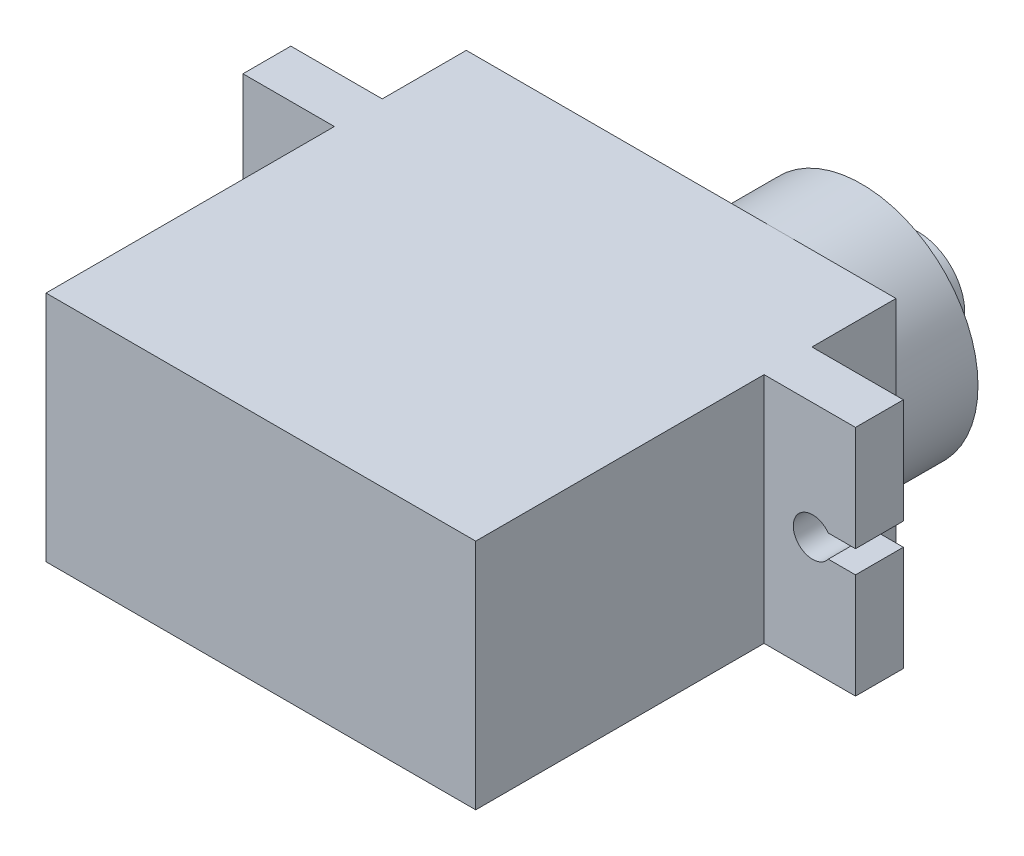
ISO-10303-21;
HEADER;
FILE_DESCRIPTION(('STEP AP214'),'2;1');
FILE_NAME('part.step','',(''),(''),'','','');
FILE_SCHEMA(('AUTOMOTIVE_DESIGN { 1 0 10303 214 1 1 1 1 }'));
ENDSEC;
DATA;
#1=APPLICATION_CONTEXT('core data for automotive mechanical design processes');
#2=APPLICATION_PROTOCOL_DEFINITION('international standard','automotive_design',2000,#1);
#3=PRODUCT_CONTEXT('',#1,'mechanical');
#4=PRODUCT('Part','Part','',(#3));
#5=PRODUCT_RELATED_PRODUCT_CATEGORY('part','',(#4));
#6=PRODUCT_DEFINITION_FORMATION('','',#4);
#7=PRODUCT_DEFINITION_CONTEXT('part definition',#1,'design');
#8=PRODUCT_DEFINITION('design','',#6,#7);
#9=PRODUCT_DEFINITION_SHAPE('','',#8);
#10=(LENGTH_UNIT() NAMED_UNIT(*) SI_UNIT(.MILLI.,.METRE.));
#11=(NAMED_UNIT(*) PLANE_ANGLE_UNIT() SI_UNIT($,.RADIAN.));
#12=(NAMED_UNIT(*) SI_UNIT($,.STERADIAN.) SOLID_ANGLE_UNIT());
#13=UNCERTAINTY_MEASURE_WITH_UNIT(LENGTH_MEASURE(1.E-05),#10,'distance_accuracy_value','');
#14=(GEOMETRIC_REPRESENTATION_CONTEXT(3) GLOBAL_UNCERTAINTY_ASSIGNED_CONTEXT((#13)) GLOBAL_UNIT_ASSIGNED_CONTEXT((#10,
#11,#12)) REPRESENTATION_CONTEXT('',''));
#15=CARTESIAN_POINT('',(0.,0.,0.));
#16=DIRECTION('',(0.,0.,1.));
#17=DIRECTION('',(1.,0.,0.));
#18=AXIS2_PLACEMENT_3D('',#15,#16,#17);
#19=CARTESIAN_POINT('',(11.4,6.175,-11.15));
#20=DIRECTION('',(0.,0.,1.));
#21=DIRECTION('',(1.,0.,0.));
#22=AXIS2_PLACEMENT_3D('',#19,#20,#21);
#23=PLANE('',#22);
#24=CARTESIAN_POINT('',(5.225,0.,-11.15));
#25=DIRECTION('',(0.,0.,-1.));
#26=DIRECTION('',(-1.,0.,0.));
#27=AXIS2_PLACEMENT_3D('',#24,#25,#26);
#28=CIRCLE('',#27,6.175);
#29=CARTESIAN_POINT('',(5.225,6.175,-11.15));
#30=VERTEX_POINT('',#29);
#31=CARTESIAN_POINT('',(11.4,0.,-11.15));
#32=VERTEX_POINT('',#31);
#33=EDGE_CURVE('E208',#30,#32,#28,.T.);
#34=ORIENTED_EDGE('',*,*,#33,.F.);
#35=DIRECTION('',(-1.,0.,0.));
#36=VECTOR('',#35,1.);
#37=CARTESIAN_POINT('',(11.4,6.175,-11.15));
#38=LINE('',#37,#36);
#39=CARTESIAN_POINT('',(11.4,6.175,-11.15));
#40=VERTEX_POINT('',#39);
#41=EDGE_CURVE('E190',#40,#30,#38,.T.);
#42=ORIENTED_EDGE('',*,*,#41,.F.);
#43=DIRECTION('',(0.,-1.,0.));
#44=VECTOR('',#43,1.);
#45=CARTESIAN_POINT('',(11.4,6.175,-11.15));
#46=LINE('',#45,#44);
#47=EDGE_CURVE('E209',#40,#32,#46,.T.);
#48=ORIENTED_EDGE('',*,*,#47,.T.);
#49=EDGE_LOOP('',(#34,#42,#48));
#50=FACE_BOUND('',#49,.T.);
#51=ADVANCED_FACE('F42',(#50),#23,.F.);
#52=CARTESIAN_POINT('',(5.225,-6.175,-11.15));
#53=VERTEX_POINT('',#52);
#54=EDGE_CURVE('E51',#32,#53,#28,.T.);
#55=ORIENTED_EDGE('',*,*,#54,.F.);
#56=CARTESIAN_POINT('',(11.4,-6.175,-11.15));
#57=VERTEX_POINT('',#56);
#58=EDGE_CURVE('E334',#32,#57,#46,.T.);
#59=ORIENTED_EDGE('',*,*,#58,.T.);
#60=DIRECTION('',(-1.,0.,0.));
#61=VECTOR('',#60,1.);
#62=CARTESIAN_POINT('',(11.4,-6.175,-11.15));
#63=LINE('',#62,#61);
#64=EDGE_CURVE('E331',#57,#53,#63,.T.);
#65=ORIENTED_EDGE('',*,*,#64,.T.);
#66=EDGE_LOOP('',(#55,#59,#65));
#67=FACE_BOUND('',#66,.T.);
#68=ADVANCED_FACE('F390',(#67),#23,.F.);
#69=CARTESIAN_POINT('',(16.25,0.,0.));
#70=DIRECTION('',(1.,0.,0.));
#71=DIRECTION('',(0.,0.,-1.));
#72=AXIS2_PLACEMENT_3D('',#69,#70,#71);
#73=PLANE('',#72);
#74=DIRECTION('',(0.,0.,-1.));
#75=VECTOR('',#74,1.);
#76=CARTESIAN_POINT('',(16.25,-0.6,0.));
#77=LINE('',#76,#75);
#78=CARTESIAN_POINT('',(16.25,-0.6,-4.15000000000001));
#79=VERTEX_POINT('',#78);
#80=CARTESIAN_POINT('',(16.25,-0.6,-6.69000000000001));
#81=VERTEX_POINT('',#80);
#82=EDGE_CURVE('E46',#79,#81,#77,.T.);
#83=ORIENTED_EDGE('',*,*,#82,.F.);
#84=DIRECTION('',(0.,-1.,0.));
#85=VECTOR('',#84,1.);
#86=CARTESIAN_POINT('',(16.25,6.175,-4.15000000000001));
#87=LINE('',#86,#85);
#88=CARTESIAN_POINT('',(16.25,-6.175,-4.15000000000001));
#89=VERTEX_POINT('',#88);
#90=EDGE_CURVE('E290',#79,#89,#87,.T.);
#91=ORIENTED_EDGE('',*,*,#90,.T.);
#92=DIRECTION('',(0.,0.,-1.));
#93=VECTOR('',#92,1.);
#94=CARTESIAN_POINT('',(16.25,-6.175,-4.15000000000001));
#95=LINE('',#94,#93);
#96=CARTESIAN_POINT('',(16.25,-6.175,-6.69000000000001));
#97=VERTEX_POINT('',#96);
#98=EDGE_CURVE('E289',#89,#97,#95,.T.);
#99=ORIENTED_EDGE('',*,*,#98,.T.);
#100=DIRECTION('',(0.,1.,0.));
#101=VECTOR('',#100,1.);
#102=CARTESIAN_POINT('',(16.25,6.175,-6.69000000000001));
#103=LINE('',#102,#101);
#104=EDGE_CURVE('E293',#97,#81,#103,.T.);
#105=ORIENTED_EDGE('',*,*,#104,.T.);
#106=EDGE_LOOP('',(#83,#91,#99,#105));
#107=FACE_BOUND('',#106,.T.);
#108=ADVANCED_FACE('F376',(#107),#73,.T.);
#109=CARTESIAN_POINT('',(-16.25,0.,0.));
#110=DIRECTION('',(-1.,0.,0.));
#111=DIRECTION('',(0.,0.,-1.));
#112=AXIS2_PLACEMENT_3D('',#109,#110,#111);
#113=PLANE('',#112);
#114=DIRECTION('',(0.,0.,-1.));
#115=VECTOR('',#114,1.);
#116=CARTESIAN_POINT('',(-16.25,0.6,0.));
#117=LINE('',#116,#115);
#118=CARTESIAN_POINT('',(-16.25,0.6,-4.15000000000001));
#119=VERTEX_POINT('',#118);
#120=CARTESIAN_POINT('',(-16.25,0.6,-6.69));
#121=VERTEX_POINT('',#120);
#122=EDGE_CURVE('E344',#119,#121,#117,.T.);
#123=ORIENTED_EDGE('',*,*,#122,.F.);
#124=DIRECTION('',(0.,-1.,0.));
#125=VECTOR('',#124,1.);
#126=CARTESIAN_POINT('',(-16.25,6.175,-4.15000000000001));
#127=LINE('',#126,#125);
#128=CARTESIAN_POINT('',(-16.25,6.175,-4.15000000000001));
#129=VERTEX_POINT('',#128);
#130=EDGE_CURVE('E258',#129,#119,#127,.T.);
#131=ORIENTED_EDGE('',*,*,#130,.F.);
#132=DIRECTION('',(0.,0.,1.));
#133=VECTOR('',#132,1.);
#134=CARTESIAN_POINT('',(-16.25,6.175,-4.15000000000001));
#135=LINE('',#134,#133);
#136=CARTESIAN_POINT('',(-16.25,6.175,-6.69000000000001));
#137=VERTEX_POINT('',#136);
#138=EDGE_CURVE('E261',#137,#129,#135,.T.);
#139=ORIENTED_EDGE('',*,*,#138,.F.);
#140=DIRECTION('',(0.,1.,0.));
#141=VECTOR('',#140,1.);
#142=CARTESIAN_POINT('',(-16.25,6.175,-6.69000000000001));
#143=LINE('',#142,#141);
#144=EDGE_CURVE('E265',#121,#137,#143,.T.);
#145=ORIENTED_EDGE('',*,*,#144,.F.);
#146=EDGE_LOOP('',(#123,#131,#139,#145));
#147=FACE_BOUND('',#146,.T.);
#148=ADVANCED_FACE('F397',(#147),#113,.T.);
#149=CARTESIAN_POINT('',(-11.4,6.175,-11.15));
#150=DIRECTION('',(1.,0.,0.));
#151=DIRECTION('',(0.,0.,-1.));
#152=AXIS2_PLACEMENT_3D('',#149,#150,#151);
#153=PLANE('',#152);
#154=DIRECTION('',(0.,0.,1.));
#155=VECTOR('',#154,1.);
#156=CARTESIAN_POINT('',(-11.4,6.175,-11.15));
#157=LINE('',#156,#155);
#158=CARTESIAN_POINT('',(-11.4,6.175,-4.15000000000001));
#159=VERTEX_POINT('',#158);
#160=CARTESIAN_POINT('',(-11.4,6.175,11.15));
#161=VERTEX_POINT('',#160);
#162=EDGE_CURVE('E318',#159,#161,#157,.T.);
#163=ORIENTED_EDGE('',*,*,#162,.F.);
#164=DIRECTION('',(0.,-1.,0.));
#165=VECTOR('',#164,1.);
#166=CARTESIAN_POINT('',(-11.4,6.175,-4.15000000000001));
#167=LINE('',#166,#165);
#168=CARTESIAN_POINT('',(-11.4,-6.175,-4.15000000000001));
#169=VERTEX_POINT('',#168);
#170=EDGE_CURVE('E257',#159,#169,#167,.T.);
#171=ORIENTED_EDGE('',*,*,#170,.T.);
#172=DIRECTION('',(0.,0.,1.));
#173=VECTOR('',#172,1.);
#174=CARTESIAN_POINT('',(-11.4,-6.175,-11.15));
#175=LINE('',#174,#173);
#176=CARTESIAN_POINT('',(-11.4,-6.175,11.15));
#177=VERTEX_POINT('',#176);
#178=EDGE_CURVE('E314',#169,#177,#175,.T.);
#179=ORIENTED_EDGE('',*,*,#178,.T.);
#180=DIRECTION('',(0.,-1.,0.));
#181=VECTOR('',#180,1.);
#182=CARTESIAN_POINT('',(-11.4,6.175,11.15));
#183=LINE('',#182,#181);
#184=EDGE_CURVE('E339',#161,#177,#183,.T.);
#185=ORIENTED_EDGE('',*,*,#184,.F.);
#186=EDGE_LOOP('',(#163,#171,#179,#185));
#187=FACE_BOUND('',#186,.T.);
#188=ADVANCED_FACE('F413',(#187),#153,.F.);
#189=CARTESIAN_POINT('',(11.4,6.175,-11.15));
#190=DIRECTION('',(-1.,0.,0.));
#191=DIRECTION('',(0.,0.,1.));
#192=AXIS2_PLACEMENT_3D('',#189,#190,#191);
#193=PLANE('',#192);
#194=DIRECTION('',(0.,-1.,0.));
#195=VECTOR('',#194,1.);
#196=CARTESIAN_POINT('',(11.4,6.175,-4.15000000000001));
#197=LINE('',#196,#195);
#198=CARTESIAN_POINT('',(11.4,6.175,-4.15000000000001));
#199=VERTEX_POINT('',#198);
#200=CARTESIAN_POINT('',(11.4,-6.175,-4.15000000000001));
#201=VERTEX_POINT('',#200);
#202=EDGE_CURVE('E285',#199,#201,#197,.T.);
#203=ORIENTED_EDGE('',*,*,#202,.F.);
#204=DIRECTION('',(0.,0.,-1.));
#205=VECTOR('',#204,1.);
#206=CARTESIAN_POINT('',(11.4,6.175,-11.15));
#207=LINE('',#206,#205);
#208=CARTESIAN_POINT('',(11.4,6.175,11.15));
#209=VERTEX_POINT('',#208);
#210=EDGE_CURVE('E206',#209,#199,#207,.T.);
#211=ORIENTED_EDGE('',*,*,#210,.F.);
#212=DIRECTION('',(0.,-1.,0.));
#213=VECTOR('',#212,1.);
#214=CARTESIAN_POINT('',(11.4,6.175,11.15));
#215=LINE('',#214,#213);
#216=CARTESIAN_POINT('',(11.4,-6.175,11.15));
#217=VERTEX_POINT('',#216);
#218=EDGE_CURVE('E336',#209,#217,#215,.T.);
#219=ORIENTED_EDGE('',*,*,#218,.T.);
#220=DIRECTION('',(0.,0.,-1.));
#221=VECTOR('',#220,1.);
#222=CARTESIAN_POINT('',(11.4,-6.175,-11.15));
#223=LINE('',#222,#221);
#224=EDGE_CURVE('E328',#217,#201,#223,.T.);
#225=ORIENTED_EDGE('',*,*,#224,.T.);
#226=EDGE_LOOP('',(#203,#211,#219,#225));
#227=FACE_BOUND('',#226,.T.);
#228=ADVANCED_FACE('F363',(#227),#193,.F.);
#229=DIRECTION('',(0.,1.,0.));
#230=VECTOR('',#229,1.);
#231=CARTESIAN_POINT('',(11.4,6.175,-6.69000000000001));
#232=LINE('',#231,#230);
#233=CARTESIAN_POINT('',(11.4,-6.175,-6.69000000000001));
#234=VERTEX_POINT('',#233);
#235=CARTESIAN_POINT('',(11.4,6.175,-6.69000000000001));
#236=VERTEX_POINT('',#235);
#237=EDGE_CURVE('E301',#234,#236,#232,.T.);
#238=ORIENTED_EDGE('',*,*,#237,.F.);
#239=EDGE_CURVE('E327',#234,#57,#223,.T.);
#240=ORIENTED_EDGE('',*,*,#239,.T.);
#241=ORIENTED_EDGE('',*,*,#58,.F.);
#242=ORIENTED_EDGE('',*,*,#47,.F.);
#243=EDGE_CURVE('E196',#236,#40,#207,.T.);
#244=ORIENTED_EDGE('',*,*,#243,.F.);
#245=EDGE_LOOP('',(#238,#240,#241,#242,#244));
#246=FACE_BOUND('',#245,.T.);
#247=ADVANCED_FACE('F388',(#246),#193,.F.);
#248=CARTESIAN_POINT('',(-11.4,-6.175,-11.15));
#249=VERTEX_POINT('',#248);
#250=CARTESIAN_POINT('',(-11.4,-6.175,-6.69000000000001));
#251=VERTEX_POINT('',#250);
#252=EDGE_CURVE('E322',#249,#251,#175,.T.);
#253=ORIENTED_EDGE('',*,*,#252,.T.);
#254=DIRECTION('',(0.,1.,0.));
#255=VECTOR('',#254,1.);
#256=CARTESIAN_POINT('',(-11.4,6.175,-6.69000000000001));
#257=LINE('',#256,#255);
#258=CARTESIAN_POINT('',(-11.4,6.175,-6.69000000000001));
#259=VERTEX_POINT('',#258);
#260=EDGE_CURVE('E275',#251,#259,#257,.T.);
#261=ORIENTED_EDGE('',*,*,#260,.T.);
#262=CARTESIAN_POINT('',(-11.4,6.175,-11.15));
#263=VERTEX_POINT('',#262);
#264=EDGE_CURVE('E315',#263,#259,#157,.T.);
#265=ORIENTED_EDGE('',*,*,#264,.F.);
#266=DIRECTION('',(0.,-1.,0.));
#267=VECTOR('',#266,1.);
#268=CARTESIAN_POINT('',(-11.4,6.175,-11.15));
#269=LINE('',#268,#267);
#270=EDGE_CURVE('E201',#263,#249,#269,.T.);
#271=ORIENTED_EDGE('',*,*,#270,.T.);
#272=EDGE_LOOP('',(#253,#261,#265,#271));
#273=FACE_BOUND('',#272,.T.);
#274=ADVANCED_FACE('F44',(#273),#153,.F.);
#275=CARTESIAN_POINT('',(11.4,6.175,11.15));
#276=DIRECTION('',(0.,0.,-1.));
#277=DIRECTION('',(-1.,0.,0.));
#278=AXIS2_PLACEMENT_3D('',#275,#276,#277);
#279=PLANE('',#278);
#280=DIRECTION('',(1.,0.,0.));
#281=VECTOR('',#280,1.);
#282=CARTESIAN_POINT('',(11.4,-6.175,11.15));
#283=LINE('',#282,#281);
#284=EDGE_CURVE('E325',#177,#217,#283,.T.);
#285=ORIENTED_EDGE('',*,*,#284,.T.);
#286=ORIENTED_EDGE('',*,*,#218,.F.);
#287=DIRECTION('',(1.,0.,0.));
#288=VECTOR('',#287,1.);
#289=CARTESIAN_POINT('',(11.4,6.175,11.15));
#290=LINE('',#289,#288);
#291=EDGE_CURVE('E317',#161,#209,#290,.T.);
#292=ORIENTED_EDGE('',*,*,#291,.F.);
#293=ORIENTED_EDGE('',*,*,#184,.T.);
#294=EDGE_LOOP('',(#285,#286,#292,#293));
#295=FACE_BOUND('',#294,.T.);
#296=ADVANCED_FACE('F402',(#295),#279,.F.);
#297=EDGE_CURVE('E66',#53,#30,#28,.T.);
#298=ORIENTED_EDGE('',*,*,#297,.F.);
#299=EDGE_CURVE('E330',#53,#249,#63,.T.);
#300=ORIENTED_EDGE('',*,*,#299,.T.);
#301=ORIENTED_EDGE('',*,*,#270,.F.);
#302=EDGE_CURVE('E193',#30,#263,#38,.T.);
#303=ORIENTED_EDGE('',*,*,#302,.F.);
#304=EDGE_LOOP('',(#298,#300,#301,#303));
#305=FACE_BOUND('',#304,.T.);
#306=ADVANCED_FACE('F203',(#305),#23,.F.);
#307=CARTESIAN_POINT('',(0.,6.175,0.));
#308=DIRECTION('',(0.,-1.,0.));
#309=DIRECTION('',(0.,0.,-1.));
#310=AXIS2_PLACEMENT_3D('',#307,#308,#309);
#311=PLANE('',#310);
#312=ORIENTED_EDGE('',*,*,#264,.T.);
#313=DIRECTION('',(1.,0.,0.));
#314=VECTOR('',#313,1.);
#315=CARTESIAN_POINT('',(-16.25,6.175,-6.69000000000001));
#316=LINE('',#315,#314);
#317=EDGE_CURVE('E281',#137,#259,#316,.T.);
#318=ORIENTED_EDGE('',*,*,#317,.F.);
#319=ORIENTED_EDGE('',*,*,#138,.T.);
#320=DIRECTION('',(1.,0.,0.));
#321=VECTOR('',#320,1.);
#322=CARTESIAN_POINT('',(-16.25,6.175,-4.15000000000001));
#323=LINE('',#322,#321);
#324=EDGE_CURVE('E283',#129,#159,#323,.T.);
#325=ORIENTED_EDGE('',*,*,#324,.T.);
#326=ORIENTED_EDGE('',*,*,#162,.T.);
#327=ORIENTED_EDGE('',*,*,#291,.T.);
#328=ORIENTED_EDGE('',*,*,#210,.T.);
#329=DIRECTION('',(-1.,0.,0.));
#330=VECTOR('',#329,1.);
#331=CARTESIAN_POINT('',(16.25,6.175,-4.15000000000001));
#332=LINE('',#331,#330);
#333=CARTESIAN_POINT('',(16.25,6.175,-4.15000000000001));
#334=VERTEX_POINT('',#333);
#335=EDGE_CURVE('E298',#334,#199,#332,.T.);
#336=ORIENTED_EDGE('',*,*,#335,.F.);
#337=DIRECTION('',(0.,0.,1.));
#338=VECTOR('',#337,1.);
#339=CARTESIAN_POINT('',(16.25,6.175,-4.15000000000001));
#340=LINE('',#339,#338);
#341=CARTESIAN_POINT('',(16.25,6.175,-6.69000000000001));
#342=VERTEX_POINT('',#341);
#343=EDGE_CURVE('E296',#342,#334,#340,.T.);
#344=ORIENTED_EDGE('',*,*,#343,.F.);
#345=DIRECTION('',(-1.,0.,0.));
#346=VECTOR('',#345,1.);
#347=CARTESIAN_POINT('',(16.25,6.175,-6.69000000000001));
#348=LINE('',#347,#346);
#349=EDGE_CURVE('E306',#342,#236,#348,.T.);
#350=ORIENTED_EDGE('',*,*,#349,.T.);
#351=ORIENTED_EDGE('',*,*,#243,.T.);
#352=ORIENTED_EDGE('',*,*,#41,.T.);
#353=ORIENTED_EDGE('',*,*,#302,.T.);
#354=EDGE_LOOP('',(#312,#318,#319,#325,#326,#327,#328,#336,#344,#350,#351,#352,#353));
#355=FACE_BOUND('',#354,.T.);
#356=ADVANCED_FACE('F192',(#355),#311,.F.);
#357=CARTESIAN_POINT('',(0.,-6.175,0.));
#358=DIRECTION('',(0.,-1.,0.));
#359=DIRECTION('',(0.,0.,-1.));
#360=AXIS2_PLACEMENT_3D('',#357,#358,#359);
#361=PLANE('',#360);
#362=ORIENTED_EDGE('',*,*,#252,.F.);
#363=ORIENTED_EDGE('',*,*,#299,.F.);
#364=ORIENTED_EDGE('',*,*,#64,.F.);
#365=ORIENTED_EDGE('',*,*,#239,.F.);
#366=DIRECTION('',(-1.,0.,0.));
#367=VECTOR('',#366,1.);
#368=CARTESIAN_POINT('',(16.25,-6.175,-6.69000000000001));
#369=LINE('',#368,#367);
#370=EDGE_CURVE('E308',#97,#234,#369,.T.);
#371=ORIENTED_EDGE('',*,*,#370,.F.);
#372=ORIENTED_EDGE('',*,*,#98,.F.);
#373=DIRECTION('',(-1.,0.,0.));
#374=VECTOR('',#373,1.);
#375=CARTESIAN_POINT('',(16.25,-6.175,-4.15000000000001));
#376=LINE('',#375,#374);
#377=EDGE_CURVE('E311',#89,#201,#376,.T.);
#378=ORIENTED_EDGE('',*,*,#377,.T.);
#379=ORIENTED_EDGE('',*,*,#224,.F.);
#380=ORIENTED_EDGE('',*,*,#284,.F.);
#381=ORIENTED_EDGE('',*,*,#178,.F.);
#382=DIRECTION('',(1.,0.,0.));
#383=VECTOR('',#382,1.);
#384=CARTESIAN_POINT('',(-16.25,-6.175,-4.15000000000001));
#385=LINE('',#384,#383);
#386=CARTESIAN_POINT('',(-16.25,-6.175,-4.15000000000001));
#387=VERTEX_POINT('',#386);
#388=EDGE_CURVE('E272',#387,#169,#385,.T.);
#389=ORIENTED_EDGE('',*,*,#388,.F.);
#390=DIRECTION('',(0.,0.,-1.));
#391=VECTOR('',#390,1.);
#392=CARTESIAN_POINT('',(-16.25,-6.175,-4.15000000000001));
#393=LINE('',#392,#391);
#394=CARTESIAN_POINT('',(-16.25,-6.175,-6.69000000000001));
#395=VERTEX_POINT('',#394);
#396=EDGE_CURVE('E269',#387,#395,#393,.T.);
#397=ORIENTED_EDGE('',*,*,#396,.T.);
#398=DIRECTION('',(1.,0.,0.));
#399=VECTOR('',#398,1.);
#400=CARTESIAN_POINT('',(-16.25,-6.175,-6.69000000000001));
#401=LINE('',#400,#399);
#402=EDGE_CURVE('E279',#395,#251,#401,.T.);
#403=ORIENTED_EDGE('',*,*,#402,.T.);
#404=EDGE_LOOP('',(#362,#363,#364,#365,#371,#372,#378,#379,#380,#381,#389,#397,#403));
#405=FACE_BOUND('',#404,.T.);
#406=ADVANCED_FACE('F370',(#405),#361,.T.);
#407=CARTESIAN_POINT('',(16.25,6.175,-4.15000000000001));
#408=DIRECTION('',(0.,0.,-1.));
#409=DIRECTION('',(-1.,0.,0.));
#410=AXIS2_PLACEMENT_3D('',#407,#408,#409);
#411=PLANE('',#410);
#412=ORIENTED_EDGE('',*,*,#90,.F.);
#413=DIRECTION('',(-1.,0.,0.));
#414=VECTOR('',#413,1.);
#415=CARTESIAN_POINT('',(16.25,-0.6,-4.15000000000001));
#416=LINE('',#415,#414);
#417=CARTESIAN_POINT('',(14.8060385069297,-0.6,-4.15000000000001));
#418=VERTEX_POINT('',#417);
#419=EDGE_CURVE('E251',#79,#418,#416,.T.);
#420=ORIENTED_EDGE('',*,*,#419,.T.);
#421=CARTESIAN_POINT('',(13.975,0.,-4.15000000000001));
#422=DIRECTION('',(0.,0.,-1.));
#423=DIRECTION('',(-1.,0.,0.));
#424=AXIS2_PLACEMENT_3D('',#421,#422,#423);
#425=CIRCLE('',#424,1.025);
#426=CARTESIAN_POINT('',(14.8060385069297,0.6,-4.15000000000001));
#427=VERTEX_POINT('',#426);
#428=EDGE_CURVE('E254',#418,#427,#425,.T.);
#429=ORIENTED_EDGE('',*,*,#428,.T.);
#430=DIRECTION('',(1.,0.,0.));
#431=VECTOR('',#430,1.);
#432=CARTESIAN_POINT('',(16.25,0.6,-4.15000000000001));
#433=LINE('',#432,#431);
#434=CARTESIAN_POINT('',(16.25,0.6,-4.15000000000001));
#435=VERTEX_POINT('',#434);
#436=EDGE_CURVE('E248',#427,#435,#433,.T.);
#437=ORIENTED_EDGE('',*,*,#436,.T.);
#438=EDGE_CURVE('E286',#334,#435,#87,.T.);
#439=ORIENTED_EDGE('',*,*,#438,.F.);
#440=ORIENTED_EDGE('',*,*,#335,.T.);
#441=ORIENTED_EDGE('',*,*,#202,.T.);
#442=ORIENTED_EDGE('',*,*,#377,.F.);
#443=EDGE_LOOP('',(#412,#420,#429,#437,#439,#440,#441,#442));
#444=FACE_BOUND('',#443,.T.);
#445=ADVANCED_FACE('F355',(#444),#411,.F.);
#446=CARTESIAN_POINT('',(16.25,6.175,-6.69000000000001));
#447=DIRECTION('',(0.,0.,1.));
#448=DIRECTION('',(1.,0.,0.));
#449=AXIS2_PLACEMENT_3D('',#446,#447,#448);
#450=PLANE('',#449);
#451=CARTESIAN_POINT('',(13.975,0.,-6.69000000000001));
#452=DIRECTION('',(0.,0.,-1.));
#453=DIRECTION('',(-1.,0.,0.));
#454=AXIS2_PLACEMENT_3D('',#451,#452,#453);
#455=CIRCLE('',#454,1.025);
#456=CARTESIAN_POINT('',(14.8060385069297,-0.6,-6.69000000000001));
#457=VERTEX_POINT('',#456);
#458=CARTESIAN_POINT('',(14.8060385069297,0.6,-6.69000000000001));
#459=VERTEX_POINT('',#458);
#460=EDGE_CURVE('E222',#457,#459,#455,.T.);
#461=ORIENTED_EDGE('',*,*,#460,.F.);
#462=DIRECTION('',(-1.,0.,0.));
#463=VECTOR('',#462,1.);
#464=CARTESIAN_POINT('',(16.25,-0.6,-6.69000000000001));
#465=LINE('',#464,#463);
#466=EDGE_CURVE('E234',#81,#457,#465,.T.);
#467=ORIENTED_EDGE('',*,*,#466,.F.);
#468=ORIENTED_EDGE('',*,*,#104,.F.);
#469=ORIENTED_EDGE('',*,*,#370,.T.);
#470=ORIENTED_EDGE('',*,*,#237,.T.);
#471=ORIENTED_EDGE('',*,*,#349,.F.);
#472=CARTESIAN_POINT('',(16.25,0.6,-6.69000000000001));
#473=VERTEX_POINT('',#472);
#474=EDGE_CURVE('E292',#473,#342,#103,.T.);
#475=ORIENTED_EDGE('',*,*,#474,.F.);
#476=DIRECTION('',(1.,0.,0.));
#477=VECTOR('',#476,1.);
#478=CARTESIAN_POINT('',(14.8060385069297,0.6,-6.69000000000001));
#479=LINE('',#478,#477);
#480=EDGE_CURVE('E239',#459,#473,#479,.T.);
#481=ORIENTED_EDGE('',*,*,#480,.F.);
#482=EDGE_LOOP('',(#461,#467,#468,#469,#470,#471,#475,#481));
#483=FACE_BOUND('',#482,.T.);
#484=ADVANCED_FACE('F385',(#483),#450,.F.);
#485=DIRECTION('',(0.,0.,1.));
#486=VECTOR('',#485,1.);
#487=CARTESIAN_POINT('',(16.25,0.6,0.));
#488=LINE('',#487,#486);
#489=EDGE_CURVE('E215',#473,#435,#488,.T.);
#490=ORIENTED_EDGE('',*,*,#489,.F.);
#491=ORIENTED_EDGE('',*,*,#474,.T.);
#492=ORIENTED_EDGE('',*,*,#343,.T.);
#493=ORIENTED_EDGE('',*,*,#438,.T.);
#494=EDGE_LOOP('',(#490,#491,#492,#493));
#495=FACE_BOUND('',#494,.T.);
#496=ADVANCED_FACE('F356',(#495),#73,.T.);
#497=CARTESIAN_POINT('',(-16.25,6.175,-4.15000000000001));
#498=DIRECTION('',(0.,0.,1.));
#499=DIRECTION('',(1.,0.,0.));
#500=AXIS2_PLACEMENT_3D('',#497,#498,#499);
#501=PLANE('',#500);
#502=DIRECTION('',(-1.,0.,0.));
#503=VECTOR('',#502,1.);
#504=CARTESIAN_POINT('',(-16.25,0.6,-4.15000000000001));
#505=LINE('',#504,#503);
#506=CARTESIAN_POINT('',(-14.8060385069297,0.6,-4.15000000000001));
#507=VERTEX_POINT('',#506);
#508=EDGE_CURVE('E244',#507,#119,#505,.T.);
#509=ORIENTED_EDGE('',*,*,#508,.F.);
#510=CARTESIAN_POINT('',(-13.975,0.,-4.15000000000001));
#511=DIRECTION('',(0.,0.,1.));
#512=DIRECTION('',(1.,0.,0.));
#513=AXIS2_PLACEMENT_3D('',#510,#511,#512);
#514=CIRCLE('',#513,1.025);
#515=CARTESIAN_POINT('',(-14.8060385069297,-0.599999999999996,-4.15000000000001));
#516=VERTEX_POINT('',#515);
#517=EDGE_CURVE('E246',#516,#507,#514,.T.);
#518=ORIENTED_EDGE('',*,*,#517,.F.);
#519=DIRECTION('',(1.,0.,0.));
#520=VECTOR('',#519,1.);
#521=CARTESIAN_POINT('',(-16.25,-0.600000000000002,-4.15000000000001));
#522=LINE('',#521,#520);
#523=CARTESIAN_POINT('',(-16.25,-0.600000000000002,-4.15000000000001));
#524=VERTEX_POINT('',#523);
#525=EDGE_CURVE('E230',#524,#516,#522,.T.);
#526=ORIENTED_EDGE('',*,*,#525,.F.);
#527=EDGE_CURVE('E262',#524,#387,#127,.T.);
#528=ORIENTED_EDGE('',*,*,#527,.T.);
#529=ORIENTED_EDGE('',*,*,#388,.T.);
#530=ORIENTED_EDGE('',*,*,#170,.F.);
#531=ORIENTED_EDGE('',*,*,#324,.F.);
#532=ORIENTED_EDGE('',*,*,#130,.T.);
#533=EDGE_LOOP('',(#509,#518,#526,#528,#529,#530,#531,#532));
#534=FACE_BOUND('',#533,.T.);
#535=ADVANCED_FACE('F450',(#534),#501,.T.);
#536=CARTESIAN_POINT('',(-16.25,6.175,-6.69000000000001));
#537=DIRECTION('',(0.,0.,-1.));
#538=DIRECTION('',(-1.,0.,0.));
#539=AXIS2_PLACEMENT_3D('',#536,#537,#538);
#540=PLANE('',#539);
#541=DIRECTION('',(1.,0.,0.));
#542=VECTOR('',#541,1.);
#543=CARTESIAN_POINT('',(-14.8060385069297,0.6,-6.69));
#544=LINE('',#543,#542);
#545=CARTESIAN_POINT('',(-14.8060385069297,0.6,-6.69));
#546=VERTEX_POINT('',#545);
#547=EDGE_CURVE('E224',#121,#546,#544,.T.);
#548=ORIENTED_EDGE('',*,*,#547,.F.);
#549=ORIENTED_EDGE('',*,*,#144,.T.);
#550=ORIENTED_EDGE('',*,*,#317,.T.);
#551=ORIENTED_EDGE('',*,*,#260,.F.);
#552=ORIENTED_EDGE('',*,*,#402,.F.);
#553=CARTESIAN_POINT('',(-16.25,-0.599999999999999,-6.69000000000001));
#554=VERTEX_POINT('',#553);
#555=EDGE_CURVE('E266',#395,#554,#143,.T.);
#556=ORIENTED_EDGE('',*,*,#555,.T.);
#557=DIRECTION('',(-1.,0.,0.));
#558=VECTOR('',#557,1.);
#559=CARTESIAN_POINT('',(-16.25,-0.600000000000002,-6.69));
#560=LINE('',#559,#558);
#561=CARTESIAN_POINT('',(-14.8060385069297,-0.599999999999996,-6.69));
#562=VERTEX_POINT('',#561);
#563=EDGE_CURVE('E221',#562,#554,#560,.T.);
#564=ORIENTED_EDGE('',*,*,#563,.F.);
#565=CARTESIAN_POINT('',(-13.975,0.,-6.69));
#566=DIRECTION('',(0.,0.,-1.));
#567=DIRECTION('',(-1.,0.,0.));
#568=AXIS2_PLACEMENT_3D('',#565,#566,#567);
#569=CIRCLE('',#568,1.025);
#570=EDGE_CURVE('E218',#546,#562,#569,.T.);
#571=ORIENTED_EDGE('',*,*,#570,.F.);
#572=EDGE_LOOP('',(#548,#549,#550,#551,#552,#556,#564,#571));
#573=FACE_BOUND('',#572,.T.);
#574=ADVANCED_FACE('F441',(#573),#540,.T.);
#575=DIRECTION('',(0.,0.,1.));
#576=VECTOR('',#575,1.);
#577=CARTESIAN_POINT('',(-16.25,-0.600000000000002,0.));
#578=LINE('',#577,#576);
#579=EDGE_CURVE('E342',#554,#524,#578,.T.);
#580=ORIENTED_EDGE('',*,*,#579,.F.);
#581=ORIENTED_EDGE('',*,*,#555,.F.);
#582=ORIENTED_EDGE('',*,*,#396,.F.);
#583=ORIENTED_EDGE('',*,*,#527,.F.);
#584=EDGE_LOOP('',(#580,#581,#582,#583));
#585=FACE_BOUND('',#584,.T.);
#586=ADVANCED_FACE('F425',(#585),#113,.T.);
#587=CARTESIAN_POINT('',(-13.975,0.,11.15));
#588=DIRECTION('',(0.,0.,-1.));
#589=DIRECTION('',(-1.,0.,0.));
#590=AXIS2_PLACEMENT_3D('',#587,#588,#589);
#591=CYLINDRICAL_SURFACE('',#590,1.025);
#592=ORIENTED_EDGE('',*,*,#517,.T.);
#593=DIRECTION('',(0.,0.,-1.));
#594=VECTOR('',#593,1.);
#595=CARTESIAN_POINT('',(-14.8060385069297,0.6,11.15));
#596=LINE('',#595,#594);
#597=EDGE_CURVE('E228',#507,#546,#596,.T.);
#598=ORIENTED_EDGE('',*,*,#597,.T.);
#599=ORIENTED_EDGE('',*,*,#570,.T.);
#600=DIRECTION('',(0.,0.,-1.));
#601=VECTOR('',#600,1.);
#602=CARTESIAN_POINT('',(-14.8060385069297,-0.599999999999996,11.15));
#603=LINE('',#602,#601);
#604=EDGE_CURVE('E227',#516,#562,#603,.T.);
#605=ORIENTED_EDGE('',*,*,#604,.F.);
#606=EDGE_LOOP('',(#592,#598,#599,#605));
#607=FACE_BOUND('',#606,.T.);
#608=ADVANCED_FACE('F457',(#607),#591,.F.);
#609=CARTESIAN_POINT('',(-14.8060385069297,0.6,11.15));
#610=DIRECTION('',(0.,1.,0.));
#611=DIRECTION('',(-1.,0.,0.));
#612=AXIS2_PLACEMENT_3D('',#609,#610,#611);
#613=PLANE('',#612);
#614=ORIENTED_EDGE('',*,*,#508,.T.);
#615=ORIENTED_EDGE('',*,*,#122,.T.);
#616=ORIENTED_EDGE('',*,*,#547,.T.);
#617=ORIENTED_EDGE('',*,*,#597,.F.);
#618=EDGE_LOOP('',(#614,#615,#616,#617));
#619=FACE_BOUND('',#618,.T.);
#620=ADVANCED_FACE('F455',(#619),#613,.F.);
#621=CARTESIAN_POINT('',(-16.25,-0.600000000000002,11.15));
#622=DIRECTION('',(0.,-1.,0.));
#623=DIRECTION('',(1.,0.,0.));
#624=AXIS2_PLACEMENT_3D('',#621,#622,#623);
#625=PLANE('',#624);
#626=ORIENTED_EDGE('',*,*,#525,.T.);
#627=ORIENTED_EDGE('',*,*,#604,.T.);
#628=ORIENTED_EDGE('',*,*,#563,.T.);
#629=ORIENTED_EDGE('',*,*,#579,.T.);
#630=EDGE_LOOP('',(#626,#627,#628,#629));
#631=FACE_BOUND('',#630,.T.);
#632=ADVANCED_FACE('F460',(#631),#625,.F.);
#633=CARTESIAN_POINT('',(13.975,0.,11.15));
#634=DIRECTION('',(0.,0.,-1.));
#635=DIRECTION('',(-1.,0.,0.));
#636=AXIS2_PLACEMENT_3D('',#633,#634,#635);
#637=CYLINDRICAL_SURFACE('',#636,1.025);
#638=DIRECTION('',(0.,0.,-1.));
#639=VECTOR('',#638,1.);
#640=CARTESIAN_POINT('',(14.8060385069297,-0.6,11.15));
#641=LINE('',#640,#639);
#642=EDGE_CURVE('E235',#418,#457,#641,.T.);
#643=ORIENTED_EDGE('',*,*,#642,.T.);
#644=ORIENTED_EDGE('',*,*,#460,.T.);
#645=DIRECTION('',(0.,0.,-1.));
#646=VECTOR('',#645,1.);
#647=CARTESIAN_POINT('',(14.8060385069297,0.6,11.15));
#648=LINE('',#647,#646);
#649=EDGE_CURVE('E232',#427,#459,#648,.T.);
#650=ORIENTED_EDGE('',*,*,#649,.F.);
#651=ORIENTED_EDGE('',*,*,#428,.F.);
#652=EDGE_LOOP('',(#643,#644,#650,#651));
#653=FACE_BOUND('',#652,.T.);
#654=ADVANCED_FACE('F383',(#653),#637,.F.);
#655=CARTESIAN_POINT('',(16.25,-0.6,11.15));
#656=DIRECTION('',(0.,-1.,0.));
#657=DIRECTION('',(1.,0.,0.));
#658=AXIS2_PLACEMENT_3D('',#655,#656,#657);
#659=PLANE('',#658);
#660=ORIENTED_EDGE('',*,*,#82,.T.);
#661=ORIENTED_EDGE('',*,*,#466,.T.);
#662=ORIENTED_EDGE('',*,*,#642,.F.);
#663=ORIENTED_EDGE('',*,*,#419,.F.);
#664=EDGE_LOOP('',(#660,#661,#662,#663));
#665=FACE_BOUND('',#664,.T.);
#666=ADVANCED_FACE('F379',(#665),#659,.F.);
#667=CARTESIAN_POINT('',(14.8060385069297,0.6,11.15));
#668=DIRECTION('',(0.,1.,0.));
#669=DIRECTION('',(-1.,0.,0.));
#670=AXIS2_PLACEMENT_3D('',#667,#668,#669);
#671=PLANE('',#670);
#672=ORIENTED_EDGE('',*,*,#649,.T.);
#673=ORIENTED_EDGE('',*,*,#480,.T.);
#674=ORIENTED_EDGE('',*,*,#489,.T.);
#675=ORIENTED_EDGE('',*,*,#436,.F.);
#676=EDGE_LOOP('',(#672,#673,#674,#675));
#677=FACE_BOUND('',#676,.T.);
#678=ADVANCED_FACE('F347',(#677),#671,.F.);
#679=CARTESIAN_POINT('',(5.225,0.,-15.5));
#680=DIRECTION('',(0.,0.,1.));
#681=DIRECTION('',(1.,0.,0.));
#682=AXIS2_PLACEMENT_3D('',#679,#680,#681);
#683=CYLINDRICAL_SURFACE('',#682,6.175);
#684=CARTESIAN_POINT('',(5.225,0.,-15.5));
#685=DIRECTION('',(0.,0.,-1.));
#686=DIRECTION('',(-1.,0.,0.));
#687=AXIS2_PLACEMENT_3D('',#684,#685,#686);
#688=CIRCLE('',#687,6.175);
#689=CARTESIAN_POINT('',(-0.950000000000002,0.,-15.5));
#690=VERTEX_POINT('',#689);
#691=EDGE_CURVE('E211',#690,#690,#688,.T.);
#692=ORIENTED_EDGE('',*,*,#691,.F.);
#693=EDGE_LOOP('',(#692));
#694=FACE_BOUND('',#693,.T.);
#695=ORIENTED_EDGE('',*,*,#33,.T.);
#696=ORIENTED_EDGE('',*,*,#54,.T.);
#697=ORIENTED_EDGE('',*,*,#297,.T.);
#698=EDGE_LOOP('',(#695,#696,#697));
#699=FACE_BOUND('',#698,.T.);
#700=ADVANCED_FACE('F214',(#694,#699),#683,.T.);
#701=CARTESIAN_POINT('',(5.225,0.,-15.5));
#702=DIRECTION('',(0.,0.,-1.));
#703=DIRECTION('',(-1.,0.,0.));
#704=AXIS2_PLACEMENT_3D('',#701,#702,#703);
#705=PLANE('',#704);
#706=CARTESIAN_POINT('',(5.225,0.,-15.5));
#707=DIRECTION('',(0.,0.,-1.));
#708=DIRECTION('',(-1.,0.,0.));
#709=AXIS2_PLACEMENT_3D('',#706,#707,#708);
#710=CIRCLE('',#709,2.475);
#711=CARTESIAN_POINT('',(2.75,0.,-15.5));
#712=VERTEX_POINT('',#711);
#713=EDGE_CURVE('E11',#712,#712,#710,.T.);
#714=ORIENTED_EDGE('',*,*,#713,.F.);
#715=EDGE_LOOP('',(#714));
#716=FACE_BOUND('',#715,.T.);
#717=ORIENTED_EDGE('',*,*,#691,.T.);
#718=EDGE_LOOP('',(#717));
#719=FACE_BOUND('',#718,.T.);
#720=ADVANCED_FACE('F685',(#716,#719),#705,.T.);
#721=CARTESIAN_POINT('',(5.225,0.,-18.5));
#722=DIRECTION('',(0.,0.,1.));
#723=DIRECTION('',(1.,0.,0.));
#724=AXIS2_PLACEMENT_3D('',#721,#722,#723);
#725=CYLINDRICAL_SURFACE('',#724,2.475);
#726=CARTESIAN_POINT('',(5.225,0.,-18.5));
#727=DIRECTION('',(0.,0.,-1.));
#728=DIRECTION('',(-1.,0.,0.));
#729=AXIS2_PLACEMENT_3D('',#726,#727,#728);
#730=CIRCLE('',#729,2.475);
#731=CARTESIAN_POINT('',(2.75,0.,-18.5));
#732=VERTEX_POINT('',#731);
#733=EDGE_CURVE('E212',#732,#732,#730,.T.);
#734=ORIENTED_EDGE('',*,*,#733,.F.);
#735=EDGE_LOOP('',(#734));
#736=FACE_BOUND('',#735,.T.);
#737=ORIENTED_EDGE('',*,*,#713,.T.);
#738=EDGE_LOOP('',(#737));
#739=FACE_BOUND('',#738,.T.);
#740=ADVANCED_FACE('F693',(#736,#739),#725,.T.);
#741=CARTESIAN_POINT('',(5.225,0.,-18.5));
#742=DIRECTION('',(0.,0.,-1.));
#743=DIRECTION('',(-1.,0.,0.));
#744=AXIS2_PLACEMENT_3D('',#741,#742,#743);
#745=PLANE('',#744);
#746=CARTESIAN_POINT('',(5.225,0.,-18.5));
#747=DIRECTION('',(0.,0.,-1.));
#748=DIRECTION('',(-1.,0.,0.));
#749=AXIS2_PLACEMENT_3D('',#746,#747,#748);
#750=CIRCLE('',#749,0.899999999999999);
#751=CARTESIAN_POINT('',(4.325,0.,-18.5));
#752=VERTEX_POINT('',#751);
#753=EDGE_CURVE('E752',#752,#752,#750,.T.);
#754=ORIENTED_EDGE('',*,*,#753,.F.);
#755=EDGE_LOOP('',(#754));
#756=FACE_BOUND('',#755,.T.);
#757=ORIENTED_EDGE('',*,*,#733,.T.);
#758=EDGE_LOOP('',(#757));
#759=FACE_BOUND('',#758,.T.);
#760=ADVANCED_FACE('F703',(#756,#759),#745,.T.);
#761=CARTESIAN_POINT('',(5.225,0.,-16.5));
#762=DIRECTION('',(0.,0.,-1.));
#763=DIRECTION('',(-1.,0.,0.));
#764=AXIS2_PLACEMENT_3D('',#761,#762,#763);
#765=CYLINDRICAL_SURFACE('',#764,0.899999999999999);
#766=CARTESIAN_POINT('',(5.225,0.,-16.5));
#767=DIRECTION('',(0.,0.,-1.));
#768=DIRECTION('',(-1.,0.,0.));
#769=AXIS2_PLACEMENT_3D('',#766,#767,#768);
#770=CIRCLE('',#769,0.899999999999999);
#771=CARTESIAN_POINT('',(4.325,0.,-16.5));
#772=VERTEX_POINT('',#771);
#773=EDGE_CURVE('E751',#772,#772,#770,.T.);
#774=ORIENTED_EDGE('',*,*,#773,.F.);
#775=EDGE_LOOP('',(#774));
#776=FACE_BOUND('',#775,.T.);
#777=ORIENTED_EDGE('',*,*,#753,.T.);
#778=EDGE_LOOP('',(#777));
#779=FACE_BOUND('',#778,.T.);
#780=ADVANCED_FACE('F713',(#776,#779),#765,.F.);
#781=CARTESIAN_POINT('',(5.225,0.,-16.5));
#782=DIRECTION('',(0.,0.,-1.));
#783=DIRECTION('',(-1.,0.,0.));
#784=AXIS2_PLACEMENT_3D('',#781,#782,#783);
#785=PLANE('',#784);
#786=ORIENTED_EDGE('',*,*,#773,.T.);
#787=EDGE_LOOP('',(#786));
#788=FACE_BOUND('',#787,.T.);
#789=ADVANCED_FACE('F723',(#788),#785,.T.);
#790=CLOSED_SHELL('',(#51,#68,#108,#148,#188,#228,#247,#274,#296,#306,#356,#406,#445,#484,#496,
#535,#574,#586,#608,#620,#632,#654,#666,#678,#700,#720,#740,#760,#780,#789));
#791=MANIFOLD_SOLID_BREP('B2',#790);
#792=ADVANCED_BREP_SHAPE_REPRESENTATION('',(#18,#791),#14);
#793=SHAPE_DEFINITION_REPRESENTATION(#9,#792);
ENDSEC;
END-ISO-10303-21;
